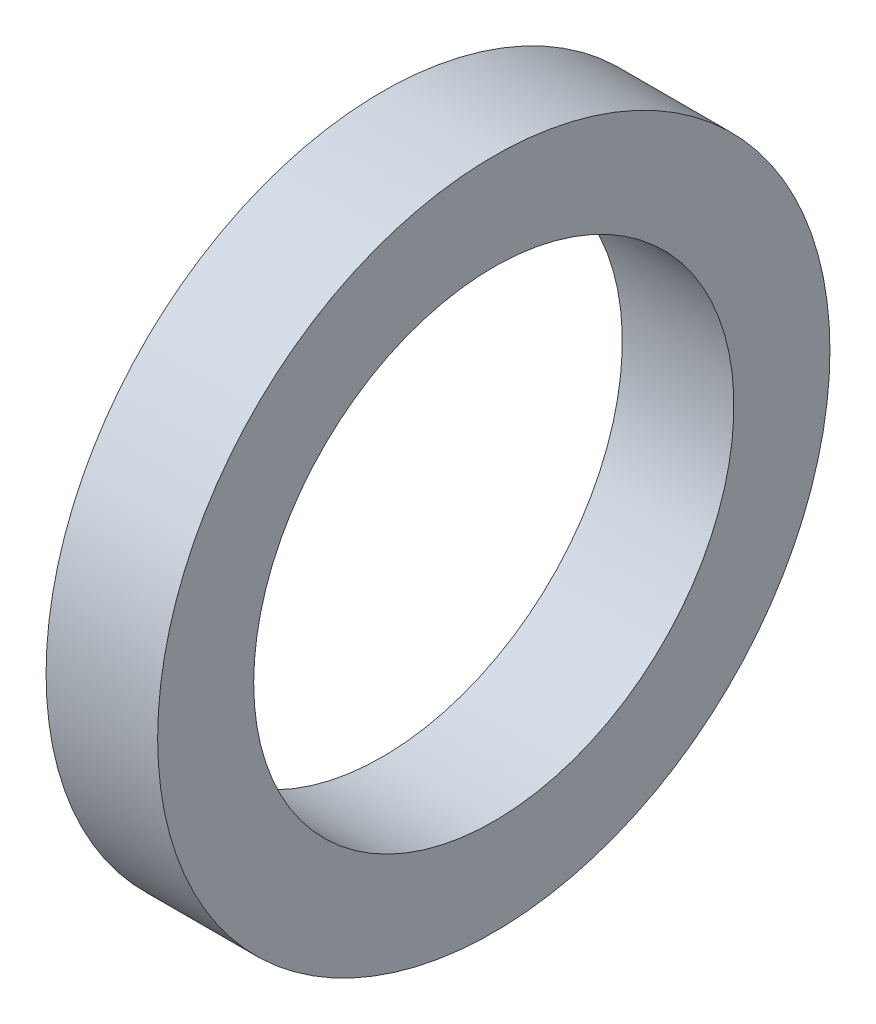
ISO-10303-21;
HEADER;
FILE_DESCRIPTION(('STEP AP214'),'2;1');
FILE_NAME('part.step','',(''),(''),'','','');
FILE_SCHEMA(('AUTOMOTIVE_DESIGN { 1 0 10303 214 1 1 1 1 }'));
ENDSEC;
DATA;
#1=APPLICATION_CONTEXT('core data for automotive mechanical design processes');
#2=APPLICATION_PROTOCOL_DEFINITION('international standard','automotive_design',2000,#1);
#3=PRODUCT_CONTEXT('',#1,'mechanical');
#4=PRODUCT('Part','Part','',(#3));
#5=PRODUCT_RELATED_PRODUCT_CATEGORY('part','',(#4));
#6=PRODUCT_DEFINITION_FORMATION('','',#4);
#7=PRODUCT_DEFINITION_CONTEXT('part definition',#1,'design');
#8=PRODUCT_DEFINITION('design','',#6,#7);
#9=PRODUCT_DEFINITION_SHAPE('','',#8);
#10=(LENGTH_UNIT() NAMED_UNIT(*) SI_UNIT(.MILLI.,.METRE.));
#11=(NAMED_UNIT(*) PLANE_ANGLE_UNIT() SI_UNIT($,.RADIAN.));
#12=(NAMED_UNIT(*) SI_UNIT($,.STERADIAN.) SOLID_ANGLE_UNIT());
#13=UNCERTAINTY_MEASURE_WITH_UNIT(LENGTH_MEASURE(1.E-05),#10,'distance_accuracy_value','');
#14=(GEOMETRIC_REPRESENTATION_CONTEXT(3) GLOBAL_UNCERTAINTY_ASSIGNED_CONTEXT((#13)) GLOBAL_UNIT_ASSIGNED_CONTEXT((#10,
#11,#12)) REPRESENTATION_CONTEXT('',''));
#15=CARTESIAN_POINT('',(0.,0.,0.));
#16=DIRECTION('',(0.,0.,1.));
#17=DIRECTION('',(1.,0.,0.));
#18=AXIS2_PLACEMENT_3D('',#15,#16,#17);
#19=CARTESIAN_POINT('',(22.939799942,14.999999972,0.));
#20=DIRECTION('',(1.,0.,0.));
#21=DIRECTION('',(0.,0.,-1.));
#22=AXIS2_PLACEMENT_3D('',#19,#20,#21);
#23=PLANE('',#22);
#24=CARTESIAN_POINT('',(22.939799942,0.,0.));
#25=DIRECTION('',(-1.,0.,0.));
#26=DIRECTION('',(0.,0.,1.));
#27=AXIS2_PLACEMENT_3D('',#24,#25,#26);
#28=CIRCLE('',#27,14.999999972);
#29=CARTESIAN_POINT('',(22.939799942,0.,14.999999972));
#30=VERTEX_POINT('',#29);
#31=EDGE_CURVE('E49',#30,#30,#28,.T.);
#32=ORIENTED_EDGE('',*,*,#31,.F.);
#33=EDGE_LOOP('',(#32));
#34=FACE_BOUND('',#33,.T.);
#35=CARTESIAN_POINT('',(22.939799942,0.,0.));
#36=DIRECTION('',(-1.,0.,0.));
#37=DIRECTION('',(0.,0.,1.));
#38=AXIS2_PLACEMENT_3D('',#35,#36,#37);
#39=CIRCLE('',#38,21.000000037);
#40=CARTESIAN_POINT('',(22.939799942,0.,21.000000037));
#41=VERTEX_POINT('',#40);
#42=EDGE_CURVE('E10',#41,#41,#39,.T.);
#43=ORIENTED_EDGE('',*,*,#42,.T.);
#44=EDGE_LOOP('',(#43));
#45=FACE_BOUND('',#44,.T.);
#46=ADVANCED_FACE('F35',(#34,#45),#23,.F.);
#47=CARTESIAN_POINT('',(0.,0.,0.));
#48=DIRECTION('',(-1.,0.,0.));
#49=DIRECTION('',(0.,0.,1.));
#50=AXIS2_PLACEMENT_3D('',#47,#48,#49);
#51=CYLINDRICAL_SURFACE('',#50,21.000000037);
#52=ORIENTED_EDGE('',*,*,#42,.F.);
#53=EDGE_LOOP('',(#52));
#54=FACE_BOUND('',#53,.T.);
#55=CARTESIAN_POINT('',(29.909799972,0.,0.));
#56=DIRECTION('',(-1.,0.,0.));
#57=DIRECTION('',(0.,0.,1.));
#58=AXIS2_PLACEMENT_3D('',#55,#56,#57);
#59=CIRCLE('',#58,21.000000037);
#60=CARTESIAN_POINT('',(29.909799972,0.,21.000000037));
#61=VERTEX_POINT('',#60);
#62=EDGE_CURVE('E41',#61,#61,#59,.T.);
#63=ORIENTED_EDGE('',*,*,#62,.T.);
#64=EDGE_LOOP('',(#63));
#65=FACE_BOUND('',#64,.T.);
#66=ADVANCED_FACE('F58',(#54,#65),#51,.T.);
#67=CARTESIAN_POINT('',(29.909799972,14.999999972,0.));
#68=DIRECTION('',(-1.,0.,0.));
#69=DIRECTION('',(0.,0.,1.));
#70=AXIS2_PLACEMENT_3D('',#67,#68,#69);
#71=PLANE('',#70);
#72=ORIENTED_EDGE('',*,*,#62,.F.);
#73=EDGE_LOOP('',(#72));
#74=FACE_BOUND('',#73,.T.);
#75=CARTESIAN_POINT('',(29.909799972,0.,0.));
#76=DIRECTION('',(-1.,0.,0.));
#77=DIRECTION('',(0.,0.,1.));
#78=AXIS2_PLACEMENT_3D('',#75,#76,#77);
#79=CIRCLE('',#78,14.999999972);
#80=CARTESIAN_POINT('',(29.909799972,0.,14.999999972));
#81=VERTEX_POINT('',#80);
#82=EDGE_CURVE('E45',#81,#81,#79,.T.);
#83=ORIENTED_EDGE('',*,*,#82,.T.);
#84=EDGE_LOOP('',(#83));
#85=FACE_BOUND('',#84,.T.);
#86=ADVANCED_FACE('F62',(#74,#85),#71,.F.);
#87=CARTESIAN_POINT('',(0.,0.,0.));
#88=DIRECTION('',(-1.,0.,0.));
#89=DIRECTION('',(0.,0.,1.));
#90=AXIS2_PLACEMENT_3D('',#87,#88,#89);
#91=CYLINDRICAL_SURFACE('',#90,14.999999972);
#92=ORIENTED_EDGE('',*,*,#82,.F.);
#93=EDGE_LOOP('',(#92));
#94=FACE_BOUND('',#93,.T.);
#95=ORIENTED_EDGE('',*,*,#31,.T.);
#96=EDGE_LOOP('',(#95));
#97=FACE_BOUND('',#96,.T.);
#98=ADVANCED_FACE('F55',(#94,#97),#91,.F.);
#99=CLOSED_SHELL('',(#46,#66,#86,#98));
#100=MANIFOLD_SOLID_BREP('B2',#99);
#101=ADVANCED_BREP_SHAPE_REPRESENTATION('',(#18,#100),#14);
#102=SHAPE_DEFINITION_REPRESENTATION(#9,#101);
ENDSEC;
END-ISO-10303-21;
